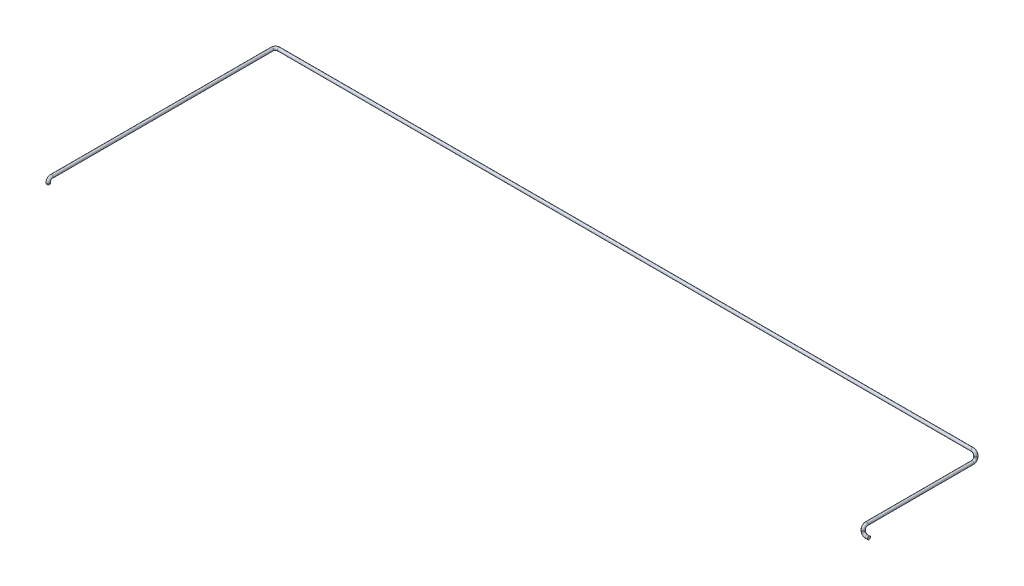
ISO-10303-21;
HEADER;
FILE_DESCRIPTION(('STEP AP214'),'2;1');
FILE_NAME('part.step','',(''),(''),'','','');
FILE_SCHEMA(('AUTOMOTIVE_DESIGN { 1 0 10303 214 1 1 1 1 }'));
ENDSEC;
DATA;
#1=APPLICATION_CONTEXT('core data for automotive mechanical design processes');
#2=APPLICATION_PROTOCOL_DEFINITION('international standard','automotive_design',2000,#1);
#3=PRODUCT_CONTEXT('',#1,'mechanical');
#4=PRODUCT('Part','Part','',(#3));
#5=PRODUCT_RELATED_PRODUCT_CATEGORY('part','',(#4));
#6=PRODUCT_DEFINITION_FORMATION('','',#4);
#7=PRODUCT_DEFINITION_CONTEXT('part definition',#1,'design');
#8=PRODUCT_DEFINITION('design','',#6,#7);
#9=PRODUCT_DEFINITION_SHAPE('','',#8);
#10=(LENGTH_UNIT() NAMED_UNIT(*) SI_UNIT(.MILLI.,.METRE.));
#11=(NAMED_UNIT(*) PLANE_ANGLE_UNIT() SI_UNIT($,.RADIAN.));
#12=(NAMED_UNIT(*) SI_UNIT($,.STERADIAN.) SOLID_ANGLE_UNIT());
#13=UNCERTAINTY_MEASURE_WITH_UNIT(LENGTH_MEASURE(1.E-05),#10,'distance_accuracy_value','');
#14=(GEOMETRIC_REPRESENTATION_CONTEXT(3) GLOBAL_UNCERTAINTY_ASSIGNED_CONTEXT((#13)) GLOBAL_UNIT_ASSIGNED_CONTEXT((#10,
#11,#12)) REPRESENTATION_CONTEXT('',''));
#15=CARTESIAN_POINT('',(0.,0.,0.));
#16=DIRECTION('',(0.,0.,1.));
#17=DIRECTION('',(1.,0.,0.));
#18=AXIS2_PLACEMENT_3D('',#15,#16,#17);
#19=CARTESIAN_POINT('',(0.,0.,0.));
#20=DIRECTION('',(1.,0.,0.));
#21=DIRECTION('',(0.,0.,-1.));
#22=AXIS2_PLACEMENT_3D('',#19,#20,#21);
#23=PLANE('',#22);
#24=CARTESIAN_POINT('',(0.,0.,0.));
#25=DIRECTION('',(1.,0.,0.));
#26=DIRECTION('',(0.,0.,-1.));
#27=AXIS2_PLACEMENT_3D('',#24,#25,#26);
#28=CIRCLE('',#27,13.7);
#29=CARTESIAN_POINT('',(0.,0.,-13.7));
#30=VERTEX_POINT('',#29);
#31=EDGE_CURVE('E46',#30,#30,#28,.T.);
#32=ORIENTED_EDGE('',*,*,#31,.T.);
#33=EDGE_LOOP('',(#32));
#34=FACE_BOUND('',#33,.T.);
#35=ADVANCED_FACE('F34',(#34),#23,.T.);
#36=CARTESIAN_POINT('',(-6275.,100.000000000001,1020.));
#37=DIRECTION('',(0.,1.,0.));
#38=DIRECTION('',(-1.,0.,0.));
#39=AXIS2_PLACEMENT_3D('',#36,#37,#38);
#40=PLANE('',#39);
#41=CARTESIAN_POINT('',(-6275.,100.000000000001,1020.));
#42=DIRECTION('',(0.,1.,0.));
#43=DIRECTION('',(-1.,0.,0.));
#44=AXIS2_PLACEMENT_3D('',#41,#42,#43);
#45=CIRCLE('',#44,13.7);
#46=CARTESIAN_POINT('',(-6288.7,100.000000000001,1020.));
#47=VERTEX_POINT('',#46);
#48=EDGE_CURVE('E11',#47,#47,#45,.T.);
#49=ORIENTED_EDGE('',*,*,#48,.F.);
#50=EDGE_LOOP('',(#49));
#51=FACE_BOUND('',#50,.T.);
#52=ADVANCED_FACE('F52',(#51),#40,.F.);
#53=CARTESIAN_POINT('',(0.,0.,0.));
#54=DIRECTION('',(-1.,0.,0.));
#55=DIRECTION('',(0.,0.,1.));
#56=AXIS2_PLACEMENT_3D('',#53,#54,#55);
#57=CYLINDRICAL_SURFACE('',#56,13.7);
#58=CARTESIAN_POINT('',(-20.,0.,0.));
#59=DIRECTION('',(1.,0.,0.));
#60=DIRECTION('',(0.,0.,-1.));
#61=AXIS2_PLACEMENT_3D('',#58,#59,#60);
#62=CIRCLE('',#61,13.7);
#63=CARTESIAN_POINT('',(-20.,-13.7,0.));
#64=VERTEX_POINT('',#63);
#65=EDGE_CURVE('E118',#64,#64,#62,.T.);
#66=ORIENTED_EDGE('',*,*,#65,.T.);
#67=EDGE_LOOP('',(#66));
#68=FACE_BOUND('',#67,.T.);
#69=ORIENTED_EDGE('',*,*,#31,.F.);
#70=EDGE_LOOP('',(#69));
#71=FACE_BOUND('',#70,.T.);
#72=ADVANCED_FACE('F54',(#68,#71),#57,.T.);
#73=CARTESIAN_POINT('',(-20.,30.,0.));
#74=DIRECTION('',(0.,0.,-1.));
#75=DIRECTION('',(-1.,0.,0.));
#76=AXIS2_PLACEMENT_3D('',#73,#74,#75);
#77=TOROIDAL_SURFACE('',#76,30.,13.7);
#78=CARTESIAN_POINT('',(-50.,30.,0.));
#79=DIRECTION('',(0.,-1.,0.));
#80=DIRECTION('',(0.,0.,-1.));
#81=AXIS2_PLACEMENT_3D('',#78,#79,#80);
#82=CIRCLE('',#81,13.7);
#83=CARTESIAN_POINT('',(-63.7,30.,0.));
#84=VERTEX_POINT('',#83);
#85=EDGE_CURVE('E115',#84,#84,#82,.T.);
#86=CARTESIAN_POINT('',(-20.,30.,0.));
#87=DIRECTION('',(0.,0.,-1.));
#88=DIRECTION('',(-1.,0.,0.));
#89=AXIS2_PLACEMENT_3D('',#86,#87,#88);
#90=CIRCLE('',#89,43.7);
#91=EDGE_CURVE('',#64,#84,#90,.T.);
#92=ORIENTED_EDGE('',*,*,#65,.F.);
#93=ORIENTED_EDGE('',*,*,#85,.T.);
#94=ORIENTED_EDGE('',*,*,#91,.T.);
#95=ORIENTED_EDGE('',*,*,#91,.F.);
#96=EDGE_LOOP('',(#92,#94,#93,#95));
#97=FACE_BOUND('',#96,.T.);
#98=ADVANCED_FACE('F59',(#97),#77,.T.);
#99=CARTESIAN_POINT('',(-50.,30.,0.));
#100=DIRECTION('',(0.,1.,0.));
#101=DIRECTION('',(0.,0.,1.));
#102=AXIS2_PLACEMENT_3D('',#99,#100,#101);
#103=CYLINDRICAL_SURFACE('',#102,13.7);
#104=CARTESIAN_POINT('',(-50.,40.,0.));
#105=DIRECTION('',(0.,-1.,0.));
#106=DIRECTION('',(0.,0.,-1.));
#107=AXIS2_PLACEMENT_3D('',#104,#105,#106);
#108=CIRCLE('',#107,13.7);
#109=CARTESIAN_POINT('',(-50.,40.,13.7));
#110=VERTEX_POINT('',#109);
#111=EDGE_CURVE('E120',#110,#110,#108,.T.);
#112=ORIENTED_EDGE('',*,*,#111,.T.);
#113=EDGE_LOOP('',(#112));
#114=FACE_BOUND('',#113,.T.);
#115=ORIENTED_EDGE('',*,*,#85,.F.);
#116=EDGE_LOOP('',(#115));
#117=FACE_BOUND('',#116,.T.);
#118=ADVANCED_FACE('F103',(#114,#117),#103,.T.);
#119=CARTESIAN_POINT('',(-50.,40.,-30.));
#120=DIRECTION('',(-1.,0.,0.));
#121=DIRECTION('',(0.,0.,1.));
#122=AXIS2_PLACEMENT_3D('',#119,#120,#121);
#123=TOROIDAL_SURFACE('',#122,30.,13.7);
#124=CARTESIAN_POINT('',(-50.,70.,-30.));
#125=DIRECTION('',(0.,0.,1.));
#126=DIRECTION('',(0.,-1.,0.));
#127=AXIS2_PLACEMENT_3D('',#124,#125,#126);
#128=CIRCLE('',#127,13.7);
#129=CARTESIAN_POINT('',(-50.,83.7,-30.));
#130=VERTEX_POINT('',#129);
#131=EDGE_CURVE('E126',#130,#130,#128,.T.);
#132=CARTESIAN_POINT('',(-50.,40.,-30.));
#133=DIRECTION('',(-1.,0.,0.));
#134=DIRECTION('',(0.,0.,1.));
#135=AXIS2_PLACEMENT_3D('',#132,#133,#134);
#136=CIRCLE('',#135,43.7);
#137=EDGE_CURVE('',#110,#130,#136,.T.);
#138=ORIENTED_EDGE('',*,*,#111,.F.);
#139=ORIENTED_EDGE('',*,*,#131,.T.);
#140=ORIENTED_EDGE('',*,*,#137,.T.);
#141=ORIENTED_EDGE('',*,*,#137,.F.);
#142=EDGE_LOOP('',(#138,#140,#139,#141));
#143=FACE_BOUND('',#142,.T.);
#144=ADVANCED_FACE('F99',(#143),#123,.T.);
#145=CARTESIAN_POINT('',(-50.,70.,-30.));
#146=DIRECTION('',(0.,0.,-1.));
#147=DIRECTION('',(-1.,0.,0.));
#148=AXIS2_PLACEMENT_3D('',#145,#146,#147);
#149=CYLINDRICAL_SURFACE('',#148,13.7);
#150=CARTESIAN_POINT('',(-50.0000000000001,70.,-970.));
#151=DIRECTION('',(0.,0.,1.));
#152=DIRECTION('',(0.,-1.,0.));
#153=AXIS2_PLACEMENT_3D('',#150,#151,#152);
#154=CIRCLE('',#153,13.7);
#155=CARTESIAN_POINT('',(-50.0000000000001,56.3,-970.));
#156=VERTEX_POINT('',#155);
#157=EDGE_CURVE('E129',#156,#156,#154,.T.);
#158=ORIENTED_EDGE('',*,*,#157,.T.);
#159=EDGE_LOOP('',(#158));
#160=FACE_BOUND('',#159,.T.);
#161=ORIENTED_EDGE('',*,*,#131,.F.);
#162=EDGE_LOOP('',(#161));
#163=FACE_BOUND('',#162,.T.);
#164=ADVANCED_FACE('F95',(#160,#163),#149,.T.);
#165=CARTESIAN_POINT('',(-50.,100.,-970.));
#166=DIRECTION('',(1.,0.,0.));
#167=DIRECTION('',(0.,0.,-1.));
#168=AXIS2_PLACEMENT_3D('',#165,#166,#167);
#169=TOROIDAL_SURFACE('',#168,30.,13.7);
#170=CARTESIAN_POINT('',(-50.,100.,-1000.));
#171=DIRECTION('',(0.,-1.,0.));
#172=DIRECTION('',(0.,0.,-1.));
#173=AXIS2_PLACEMENT_3D('',#170,#171,#172);
#174=CIRCLE('',#173,13.7);
#175=CARTESIAN_POINT('',(-50.,100.,-1013.7));
#176=VERTEX_POINT('',#175);
#177=EDGE_CURVE('E132',#176,#176,#174,.T.);
#178=CARTESIAN_POINT('',(-50.,100.,-970.));
#179=DIRECTION('',(1.,0.,0.));
#180=DIRECTION('',(0.,0.,-1.));
#181=AXIS2_PLACEMENT_3D('',#178,#179,#180);
#182=CIRCLE('',#181,43.7);
#183=EDGE_CURVE('',#156,#176,#182,.T.);
#184=ORIENTED_EDGE('',*,*,#157,.F.);
#185=ORIENTED_EDGE('',*,*,#177,.T.);
#186=ORIENTED_EDGE('',*,*,#183,.T.);
#187=ORIENTED_EDGE('',*,*,#183,.F.);
#188=EDGE_LOOP('',(#184,#186,#185,#187));
#189=FACE_BOUND('',#188,.T.);
#190=ADVANCED_FACE('F91',(#189),#169,.T.);
#191=CARTESIAN_POINT('',(-50.0000000000001,100.,-1000.));
#192=DIRECTION('',(0.,1.,0.));
#193=DIRECTION('',(0.,0.,1.));
#194=AXIS2_PLACEMENT_3D('',#191,#192,#193);
#195=CYLINDRICAL_SURFACE('',#194,13.7);
#196=CARTESIAN_POINT('',(-50.0000000000001,110.,-1000.));
#197=DIRECTION('',(0.,-1.,0.));
#198=DIRECTION('',(0.,0.,-1.));
#199=AXIS2_PLACEMENT_3D('',#196,#197,#198);
#200=CIRCLE('',#199,13.7);
#201=CARTESIAN_POINT('',(-36.3000000000001,110.,-1000.));
#202=VERTEX_POINT('',#201);
#203=EDGE_CURVE('E135',#202,#202,#200,.T.);
#204=ORIENTED_EDGE('',*,*,#203,.T.);
#205=EDGE_LOOP('',(#204));
#206=FACE_BOUND('',#205,.T.);
#207=ORIENTED_EDGE('',*,*,#177,.F.);
#208=EDGE_LOOP('',(#207));
#209=FACE_BOUND('',#208,.T.);
#210=ADVANCED_FACE('F87',(#206,#209),#195,.T.);
#211=CARTESIAN_POINT('',(-80.0000000000001,110.,-1000.));
#212=DIRECTION('',(0.,0.,1.));
#213=DIRECTION('',(1.,0.,0.));
#214=AXIS2_PLACEMENT_3D('',#211,#212,#213);
#215=TOROIDAL_SURFACE('',#214,30.,13.7);
#216=CARTESIAN_POINT('',(-80.0000000000001,140.,-1000.));
#217=DIRECTION('',(1.,0.,0.));
#218=DIRECTION('',(0.,0.,-1.));
#219=AXIS2_PLACEMENT_3D('',#216,#217,#218);
#220=CIRCLE('',#219,13.7);
#221=CARTESIAN_POINT('',(-80.0000000000001,153.7,-1000.));
#222=VERTEX_POINT('',#221);
#223=EDGE_CURVE('E138',#222,#222,#220,.T.);
#224=CARTESIAN_POINT('',(-80.0000000000001,110.,-1000.));
#225=DIRECTION('',(0.,0.,1.));
#226=DIRECTION('',(1.,0.,0.));
#227=AXIS2_PLACEMENT_3D('',#224,#225,#226);
#228=CIRCLE('',#227,43.7);
#229=EDGE_CURVE('',#202,#222,#228,.T.);
#230=ORIENTED_EDGE('',*,*,#203,.F.);
#231=ORIENTED_EDGE('',*,*,#223,.T.);
#232=ORIENTED_EDGE('',*,*,#229,.T.);
#233=ORIENTED_EDGE('',*,*,#229,.F.);
#234=EDGE_LOOP('',(#230,#232,#231,#233));
#235=FACE_BOUND('',#234,.T.);
#236=ADVANCED_FACE('F83',(#235),#215,.T.);
#237=CARTESIAN_POINT('',(-80.0000000000001,140.,-1000.));
#238=DIRECTION('',(-1.,0.,0.));
#239=DIRECTION('',(0.,-1.,0.));
#240=AXIS2_PLACEMENT_3D('',#237,#238,#239);
#241=CYLINDRICAL_SURFACE('',#240,13.7);
#242=CARTESIAN_POINT('',(-6245.,140.,-1000.));
#243=DIRECTION('',(1.,0.,0.));
#244=DIRECTION('',(0.,0.,-1.));
#245=AXIS2_PLACEMENT_3D('',#242,#243,#244);
#246=CIRCLE('',#245,13.7);
#247=CARTESIAN_POINT('',(-6245.,140.,-1013.7));
#248=VERTEX_POINT('',#247);
#249=EDGE_CURVE('E141',#248,#248,#246,.T.);
#250=ORIENTED_EDGE('',*,*,#249,.T.);
#251=EDGE_LOOP('',(#250));
#252=FACE_BOUND('',#251,.T.);
#253=ORIENTED_EDGE('',*,*,#223,.F.);
#254=EDGE_LOOP('',(#253));
#255=FACE_BOUND('',#254,.T.);
#256=ADVANCED_FACE('F79',(#252,#255),#241,.T.);
#257=CARTESIAN_POINT('',(-6245.,140.,-970.));
#258=DIRECTION('',(0.,1.,0.));
#259=DIRECTION('',(0.,0.,1.));
#260=AXIS2_PLACEMENT_3D('',#257,#258,#259);
#261=TOROIDAL_SURFACE('',#260,30.,13.7);
#262=CARTESIAN_POINT('',(-6275.,140.,-970.));
#263=DIRECTION('',(0.,0.,-1.));
#264=DIRECTION('',(-1.,0.,0.));
#265=AXIS2_PLACEMENT_3D('',#262,#263,#264);
#266=CIRCLE('',#265,13.7);
#267=CARTESIAN_POINT('',(-6288.7,140.,-970.));
#268=VERTEX_POINT('',#267);
#269=EDGE_CURVE('E144',#268,#268,#266,.T.);
#270=CARTESIAN_POINT('',(-6245.,140.,-970.));
#271=DIRECTION('',(0.,1.,0.));
#272=DIRECTION('',(0.,0.,1.));
#273=AXIS2_PLACEMENT_3D('',#270,#271,#272);
#274=CIRCLE('',#273,43.7);
#275=EDGE_CURVE('',#248,#268,#274,.T.);
#276=ORIENTED_EDGE('',*,*,#249,.F.);
#277=ORIENTED_EDGE('',*,*,#269,.T.);
#278=ORIENTED_EDGE('',*,*,#275,.T.);
#279=ORIENTED_EDGE('',*,*,#275,.F.);
#280=EDGE_LOOP('',(#276,#278,#277,#279));
#281=FACE_BOUND('',#280,.T.);
#282=ADVANCED_FACE('F75',(#281),#261,.T.);
#283=CARTESIAN_POINT('',(-6275.,140.,-970.));
#284=DIRECTION('',(0.,0.,1.));
#285=DIRECTION('',(0.,-1.,0.));
#286=AXIS2_PLACEMENT_3D('',#283,#284,#285);
#287=CYLINDRICAL_SURFACE('',#286,13.7);
#288=CARTESIAN_POINT('',(-6275.,140.000000000001,990.));
#289=DIRECTION('',(0.,0.,-1.));
#290=DIRECTION('',(-1.,0.,0.));
#291=AXIS2_PLACEMENT_3D('',#288,#289,#290);
#292=CIRCLE('',#291,13.7);
#293=CARTESIAN_POINT('',(-6275.,153.700000000001,990.));
#294=VERTEX_POINT('',#293);
#295=EDGE_CURVE('E147',#294,#294,#292,.T.);
#296=ORIENTED_EDGE('',*,*,#295,.T.);
#297=EDGE_LOOP('',(#296));
#298=FACE_BOUND('',#297,.T.);
#299=ORIENTED_EDGE('',*,*,#269,.F.);
#300=EDGE_LOOP('',(#299));
#301=FACE_BOUND('',#300,.T.);
#302=ADVANCED_FACE('F69',(#298,#301),#287,.T.);
#303=CARTESIAN_POINT('',(-6275.,110.000000000001,990.));
#304=DIRECTION('',(1.,0.,0.));
#305=DIRECTION('',(0.,0.,-1.));
#306=AXIS2_PLACEMENT_3D('',#303,#304,#305);
#307=TOROIDAL_SURFACE('',#306,30.,13.7);
#308=CARTESIAN_POINT('',(-6275.,110.000000000001,1020.));
#309=DIRECTION('',(0.,1.,0.));
#310=DIRECTION('',(-1.,0.,0.));
#311=AXIS2_PLACEMENT_3D('',#308,#309,#310);
#312=CIRCLE('',#311,13.7);
#313=CARTESIAN_POINT('',(-6275.,110.000000000001,1033.7));
#314=VERTEX_POINT('',#313);
#315=EDGE_CURVE('E41',#314,#314,#312,.T.);
#316=CARTESIAN_POINT('',(-6275.,110.000000000001,990.));
#317=DIRECTION('',(1.,0.,0.));
#318=DIRECTION('',(0.,0.,-1.));
#319=AXIS2_PLACEMENT_3D('',#316,#317,#318);
#320=CIRCLE('',#319,43.7);
#321=EDGE_CURVE('',#294,#314,#320,.T.);
#322=ORIENTED_EDGE('',*,*,#295,.F.);
#323=ORIENTED_EDGE('',*,*,#315,.T.);
#324=ORIENTED_EDGE('',*,*,#321,.T.);
#325=ORIENTED_EDGE('',*,*,#321,.F.);
#326=EDGE_LOOP('',(#322,#324,#323,#325));
#327=FACE_BOUND('',#326,.T.);
#328=ADVANCED_FACE('F65',(#327),#307,.T.);
#329=CARTESIAN_POINT('',(-6275.,110.000000000001,1020.));
#330=DIRECTION('',(0.,-1.,0.));
#331=DIRECTION('',(0.,0.,-1.));
#332=AXIS2_PLACEMENT_3D('',#329,#330,#331);
#333=CYLINDRICAL_SURFACE('',#332,13.7);
#334=ORIENTED_EDGE('',*,*,#48,.T.);
#335=EDGE_LOOP('',(#334));
#336=FACE_BOUND('',#335,.T.);
#337=ORIENTED_EDGE('',*,*,#315,.F.);
#338=EDGE_LOOP('',(#337));
#339=FACE_BOUND('',#338,.T.);
#340=ADVANCED_FACE('F49',(#336,#339),#333,.T.);
#341=CLOSED_SHELL('',(#35,#52,#72,#98,#118,#144,#164,#190,#210,#236,#256,#282,#302,#328,#340));
#342=MANIFOLD_SOLID_BREP('B2',#341);
#343=ADVANCED_BREP_SHAPE_REPRESENTATION('',(#18,#342),#14);
#344=SHAPE_DEFINITION_REPRESENTATION(#9,#343);
ENDSEC;
END-ISO-10303-21;
